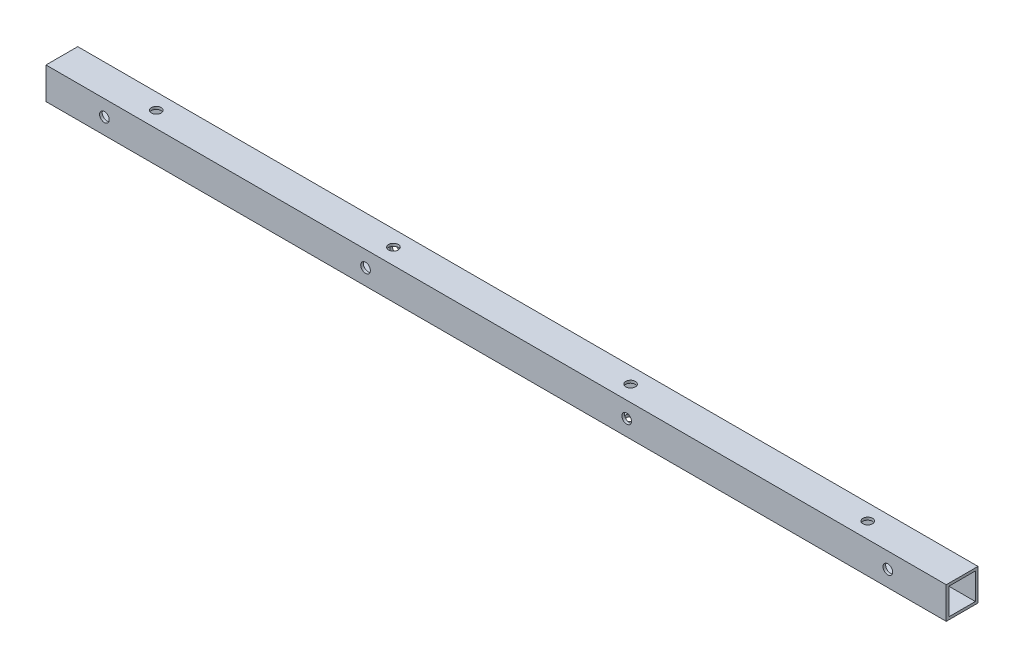
ISO-10303-21;
HEADER;
FILE_DESCRIPTION(('STEP AP214'),'2;1');
FILE_NAME('part.step','',(''),(''),'','','');
FILE_SCHEMA(('AUTOMOTIVE_DESIGN { 1 0 10303 214 1 1 1 1 }'));
ENDSEC;
DATA;
#1=APPLICATION_CONTEXT('core data for automotive mechanical design processes');
#2=APPLICATION_PROTOCOL_DEFINITION('international standard','automotive_design',2000,#1);
#3=PRODUCT_CONTEXT('',#1,'mechanical');
#4=PRODUCT('Part','Part','',(#3));
#5=PRODUCT_RELATED_PRODUCT_CATEGORY('part','',(#4));
#6=PRODUCT_DEFINITION_FORMATION('','',#4);
#7=PRODUCT_DEFINITION_CONTEXT('part definition',#1,'design');
#8=PRODUCT_DEFINITION('design','',#6,#7);
#9=PRODUCT_DEFINITION_SHAPE('','',#8);
#10=(LENGTH_UNIT() NAMED_UNIT(*) SI_UNIT(.MILLI.,.METRE.));
#11=(NAMED_UNIT(*) PLANE_ANGLE_UNIT() SI_UNIT($,.RADIAN.));
#12=(NAMED_UNIT(*) SI_UNIT($,.STERADIAN.) SOLID_ANGLE_UNIT());
#13=UNCERTAINTY_MEASURE_WITH_UNIT(LENGTH_MEASURE(1.E-05),#10,'distance_accuracy_value','');
#14=(GEOMETRIC_REPRESENTATION_CONTEXT(3) GLOBAL_UNCERTAINTY_ASSIGNED_CONTEXT((#13)) GLOBAL_UNIT_ASSIGNED_CONTEXT((#10,
#11,#12)) REPRESENTATION_CONTEXT('',''));
#15=CARTESIAN_POINT('',(0.,0.,0.));
#16=DIRECTION('',(0.,0.,1.));
#17=DIRECTION('',(1.,0.,0.));
#18=AXIS2_PLACEMENT_3D('',#15,#16,#17);
#19=CARTESIAN_POINT('',(483.3366,-9.52500000000001,0.));
#20=DIRECTION('',(0.,1.,0.));
#21=DIRECTION('',(0.,0.,1.));
#22=AXIS2_PLACEMENT_3D('',#19,#20,#21);
#23=CYLINDRICAL_SURFACE('',#22,2.8956);
#24=CARTESIAN_POINT('',(483.3366,7.9375,0.));
#25=DIRECTION('',(0.,-1.,0.));
#26=DIRECTION('',(0.,0.,-1.));
#27=AXIS2_PLACEMENT_3D('',#24,#25,#26);
#28=CIRCLE('',#27,2.8956);
#29=CARTESIAN_POINT('',(483.3366,7.9375,-2.8956));
#30=VERTEX_POINT('',#29);
#31=EDGE_CURVE('E40',#30,#30,#28,.T.);
#32=ORIENTED_EDGE('',*,*,#31,.T.);
#33=EDGE_LOOP('',(#32));
#34=FACE_BOUND('',#33,.T.);
#35=CARTESIAN_POINT('',(483.3366,9.525,0.));
#36=DIRECTION('',(0.,1.,0.));
#37=DIRECTION('',(0.,0.,1.));
#38=AXIS2_PLACEMENT_3D('',#35,#36,#37);
#39=CIRCLE('',#38,2.8956);
#40=CARTESIAN_POINT('',(483.3366,9.525,2.8956));
#41=VERTEX_POINT('',#40);
#42=EDGE_CURVE('E11',#41,#41,#39,.T.);
#43=ORIENTED_EDGE('',*,*,#42,.T.);
#44=EDGE_LOOP('',(#43));
#45=FACE_BOUND('',#44,.T.);
#46=ADVANCED_FACE('F33',(#34,#45),#23,.F.);
#47=CARTESIAN_POINT('',(341.0966,-9.52500000000001,0.));
#48=DIRECTION('',(0.,1.,0.));
#49=DIRECTION('',(0.,0.,1.));
#50=AXIS2_PLACEMENT_3D('',#47,#48,#49);
#51=CYLINDRICAL_SURFACE('',#50,2.8956);
#52=CARTESIAN_POINT('',(341.0966,7.9375,0.));
#53=DIRECTION('',(0.,-1.,0.));
#54=DIRECTION('',(0.,0.,-1.));
#55=AXIS2_PLACEMENT_3D('',#52,#53,#54);
#56=CIRCLE('',#55,2.8956);
#57=CARTESIAN_POINT('',(341.0966,7.9375,-2.8956));
#58=VERTEX_POINT('',#57);
#59=EDGE_CURVE('E212',#58,#58,#56,.T.);
#60=ORIENTED_EDGE('',*,*,#59,.T.);
#61=EDGE_LOOP('',(#60));
#62=FACE_BOUND('',#61,.T.);
#63=CARTESIAN_POINT('',(341.0966,9.525,0.));
#64=DIRECTION('',(0.,1.,0.));
#65=DIRECTION('',(0.,0.,1.));
#66=AXIS2_PLACEMENT_3D('',#63,#64,#65);
#67=CIRCLE('',#66,2.8956);
#68=CARTESIAN_POINT('',(341.0966,9.525,2.8956));
#69=VERTEX_POINT('',#68);
#70=EDGE_CURVE('E215',#69,#69,#67,.T.);
#71=ORIENTED_EDGE('',*,*,#70,.T.);
#72=EDGE_LOOP('',(#71));
#73=FACE_BOUND('',#72,.T.);
#74=ADVANCED_FACE('F239',(#62,#73),#51,.F.);
#75=CARTESIAN_POINT('',(483.3366,-9.52500000000001,0.));
#76=DIRECTION('',(0.,1.,0.));
#77=DIRECTION('',(0.,0.,1.));
#78=AXIS2_PLACEMENT_3D('',#75,#76,#77);
#79=CYLINDRICAL_SURFACE('',#78,2.8956);
#80=CARTESIAN_POINT('',(483.3366,-7.9375,0.));
#81=DIRECTION('',(0.,1.,0.));
#82=DIRECTION('',(0.,0.,1.));
#83=AXIS2_PLACEMENT_3D('',#80,#81,#82);
#84=CIRCLE('',#83,2.8956);
#85=CARTESIAN_POINT('',(483.3366,-7.9375,2.8956));
#86=VERTEX_POINT('',#85);
#87=EDGE_CURVE('E206',#86,#86,#84,.T.);
#88=ORIENTED_EDGE('',*,*,#87,.T.);
#89=EDGE_LOOP('',(#88));
#90=FACE_BOUND('',#89,.T.);
#91=CARTESIAN_POINT('',(483.3366,-9.52500000000001,0.));
#92=DIRECTION('',(0.,1.,0.));
#93=DIRECTION('',(0.,0.,1.));
#94=AXIS2_PLACEMENT_3D('',#91,#92,#93);
#95=CIRCLE('',#94,2.8956);
#96=CARTESIAN_POINT('',(483.3366,-9.52500000000001,2.8956));
#97=VERTEX_POINT('',#96);
#98=EDGE_CURVE('E209',#97,#97,#95,.T.);
#99=ORIENTED_EDGE('',*,*,#98,.F.);
#100=EDGE_LOOP('',(#99));
#101=FACE_BOUND('',#100,.T.);
#102=ADVANCED_FACE('F243',(#90,#101),#79,.F.);
#103=CARTESIAN_POINT('',(341.0966,-9.52500000000001,0.));
#104=DIRECTION('',(0.,1.,0.));
#105=DIRECTION('',(0.,0.,1.));
#106=AXIS2_PLACEMENT_3D('',#103,#104,#105);
#107=CYLINDRICAL_SURFACE('',#106,2.8956);
#108=CARTESIAN_POINT('',(341.0966,-7.9375,0.));
#109=DIRECTION('',(0.,1.,0.));
#110=DIRECTION('',(0.,0.,1.));
#111=AXIS2_PLACEMENT_3D('',#108,#109,#110);
#112=CIRCLE('',#111,2.8956);
#113=CARTESIAN_POINT('',(341.0966,-7.9375,2.8956));
#114=VERTEX_POINT('',#113);
#115=EDGE_CURVE('E195',#114,#114,#112,.T.);
#116=ORIENTED_EDGE('',*,*,#115,.T.);
#117=EDGE_LOOP('',(#116));
#118=FACE_BOUND('',#117,.T.);
#119=CARTESIAN_POINT('',(341.0966,-9.52500000000001,0.));
#120=DIRECTION('',(0.,1.,0.));
#121=DIRECTION('',(0.,0.,1.));
#122=AXIS2_PLACEMENT_3D('',#119,#120,#121);
#123=CIRCLE('',#122,2.8956);
#124=CARTESIAN_POINT('',(341.0966,-9.52500000000001,2.8956));
#125=VERTEX_POINT('',#124);
#126=EDGE_CURVE('E203',#125,#125,#123,.T.);
#127=ORIENTED_EDGE('',*,*,#126,.F.);
#128=EDGE_LOOP('',(#127));
#129=FACE_BOUND('',#128,.T.);
#130=ADVANCED_FACE('F248',(#118,#129),#107,.F.);
#131=CARTESIAN_POINT('',(35.0265999999999,0.,-9.525));
#132=DIRECTION('',(0.,0.,1.));
#133=DIRECTION('',(1.,0.,0.));
#134=AXIS2_PLACEMENT_3D('',#131,#132,#133);
#135=CYLINDRICAL_SURFACE('',#134,2.89559999999999);
#136=CARTESIAN_POINT('',(35.0265999999999,0.,7.9375));
#137=DIRECTION('',(0.,0.,-1.));
#138=DIRECTION('',(-1.,0.,0.));
#139=AXIS2_PLACEMENT_3D('',#136,#137,#138);
#140=CIRCLE('',#139,2.89559999999999);
#141=CARTESIAN_POINT('',(32.1309999999999,0.,7.9375));
#142=VERTEX_POINT('',#141);
#143=EDGE_CURVE('E189',#142,#142,#140,.T.);
#144=ORIENTED_EDGE('',*,*,#143,.T.);
#145=EDGE_LOOP('',(#144));
#146=FACE_BOUND('',#145,.T.);
#147=CARTESIAN_POINT('',(35.0265999999999,0.,9.525));
#148=DIRECTION('',(0.,0.,1.));
#149=DIRECTION('',(1.,0.,0.));
#150=AXIS2_PLACEMENT_3D('',#147,#148,#149);
#151=CIRCLE('',#150,2.89559999999999);
#152=CARTESIAN_POINT('',(37.9221999999998,0.,9.525));
#153=VERTEX_POINT('',#152);
#154=EDGE_CURVE('E192',#153,#153,#151,.T.);
#155=ORIENTED_EDGE('',*,*,#154,.T.);
#156=EDGE_LOOP('',(#155));
#157=FACE_BOUND('',#156,.T.);
#158=ADVANCED_FACE('F255',(#146,#157),#135,.F.);
#159=CARTESIAN_POINT('',(191.659933333333,0.,-9.525));
#160=DIRECTION('',(0.,0.,1.));
#161=DIRECTION('',(1.,0.,0.));
#162=AXIS2_PLACEMENT_3D('',#159,#160,#161);
#163=CYLINDRICAL_SURFACE('',#162,2.89559999999999);
#164=CARTESIAN_POINT('',(191.659933333333,0.,7.9375));
#165=DIRECTION('',(0.,0.,-1.));
#166=DIRECTION('',(-1.,0.,0.));
#167=AXIS2_PLACEMENT_3D('',#164,#165,#166);
#168=CIRCLE('',#167,2.89559999999999);
#169=CARTESIAN_POINT('',(188.764333333333,0.,7.9375));
#170=VERTEX_POINT('',#169);
#171=EDGE_CURVE('E183',#170,#170,#168,.T.);
#172=ORIENTED_EDGE('',*,*,#171,.T.);
#173=EDGE_LOOP('',(#172));
#174=FACE_BOUND('',#173,.T.);
#175=CARTESIAN_POINT('',(191.659933333333,0.,9.525));
#176=DIRECTION('',(0.,0.,1.));
#177=DIRECTION('',(1.,0.,0.));
#178=AXIS2_PLACEMENT_3D('',#175,#176,#177);
#179=CIRCLE('',#178,2.89559999999999);
#180=CARTESIAN_POINT('',(194.555533333333,0.,9.525));
#181=VERTEX_POINT('',#180);
#182=EDGE_CURVE('E186',#181,#181,#179,.T.);
#183=ORIENTED_EDGE('',*,*,#182,.T.);
#184=EDGE_LOOP('',(#183));
#185=FACE_BOUND('',#184,.T.);
#186=ADVANCED_FACE('F259',(#174,#185),#163,.F.);
#187=CARTESIAN_POINT('',(35.0265999999999,0.,-9.525));
#188=DIRECTION('',(0.,0.,1.));
#189=DIRECTION('',(1.,0.,0.));
#190=AXIS2_PLACEMENT_3D('',#187,#188,#189);
#191=CYLINDRICAL_SURFACE('',#190,2.89559999999999);
#192=CARTESIAN_POINT('',(35.0265999999999,0.,-7.9375));
#193=DIRECTION('',(0.,0.,1.));
#194=DIRECTION('',(1.,0.,0.));
#195=AXIS2_PLACEMENT_3D('',#192,#193,#194);
#196=CIRCLE('',#195,2.89559999999999);
#197=CARTESIAN_POINT('',(37.9221999999998,0.,-7.9375));
#198=VERTEX_POINT('',#197);
#199=EDGE_CURVE('E177',#198,#198,#196,.T.);
#200=ORIENTED_EDGE('',*,*,#199,.T.);
#201=EDGE_LOOP('',(#200));
#202=FACE_BOUND('',#201,.T.);
#203=CARTESIAN_POINT('',(35.0265999999999,0.,-9.525));
#204=DIRECTION('',(0.,0.,1.));
#205=DIRECTION('',(1.,0.,0.));
#206=AXIS2_PLACEMENT_3D('',#203,#204,#205);
#207=CIRCLE('',#206,2.89559999999999);
#208=CARTESIAN_POINT('',(37.9221999999998,0.,-9.525));
#209=VERTEX_POINT('',#208);
#210=EDGE_CURVE('E180',#209,#209,#207,.T.);
#211=ORIENTED_EDGE('',*,*,#210,.F.);
#212=EDGE_LOOP('',(#211));
#213=FACE_BOUND('',#212,.T.);
#214=ADVANCED_FACE('F263',(#202,#213),#191,.F.);
#215=CARTESIAN_POINT('',(191.659933333333,0.,-9.525));
#216=DIRECTION('',(0.,0.,1.));
#217=DIRECTION('',(1.,0.,0.));
#218=AXIS2_PLACEMENT_3D('',#215,#216,#217);
#219=CYLINDRICAL_SURFACE('',#218,2.89559999999999);
#220=CARTESIAN_POINT('',(191.659933333333,0.,-7.9375));
#221=DIRECTION('',(0.,0.,1.));
#222=DIRECTION('',(1.,0.,0.));
#223=AXIS2_PLACEMENT_3D('',#220,#221,#222);
#224=CIRCLE('',#223,2.89559999999999);
#225=CARTESIAN_POINT('',(194.555533333333,0.,-7.9375));
#226=VERTEX_POINT('',#225);
#227=EDGE_CURVE('E167',#226,#226,#224,.T.);
#228=ORIENTED_EDGE('',*,*,#227,.T.);
#229=EDGE_LOOP('',(#228));
#230=FACE_BOUND('',#229,.T.);
#231=CARTESIAN_POINT('',(191.659933333333,0.,-9.525));
#232=DIRECTION('',(0.,0.,1.));
#233=DIRECTION('',(1.,0.,0.));
#234=AXIS2_PLACEMENT_3D('',#231,#232,#233);
#235=CIRCLE('',#234,2.89559999999999);
#236=CARTESIAN_POINT('',(194.555533333333,0.,-9.525));
#237=VERTEX_POINT('',#236);
#238=EDGE_CURVE('E174',#237,#237,#235,.T.);
#239=ORIENTED_EDGE('',*,*,#238,.F.);
#240=EDGE_LOOP('',(#239));
#241=FACE_BOUND('',#240,.T.);
#242=ADVANCED_FACE('F267',(#230,#241),#219,.F.);
#243=CARTESIAN_POINT('',(539.9532,0.,0.));
#244=DIRECTION('',(1.,0.,0.));
#245=DIRECTION('',(0.,0.,-1.));
#246=AXIS2_PLACEMENT_3D('',#243,#244,#245);
#247=PLANE('',#246);
#248=DIRECTION('',(0.,0.,-1.));
#249=VECTOR('',#248,1.);
#250=CARTESIAN_POINT('',(539.9532,-9.525,-9.525));
#251=LINE('',#250,#249);
#252=CARTESIAN_POINT('',(539.9532,-9.525,9.525));
#253=VERTEX_POINT('',#252);
#254=CARTESIAN_POINT('',(539.9532,-9.525,-9.525));
#255=VERTEX_POINT('',#254);
#256=EDGE_CURVE('E138',#253,#255,#251,.T.);
#257=ORIENTED_EDGE('',*,*,#256,.T.);
#258=DIRECTION('',(0.,1.,0.));
#259=VECTOR('',#258,1.);
#260=CARTESIAN_POINT('',(539.9532,9.525,-9.525));
#261=LINE('',#260,#259);
#262=CARTESIAN_POINT('',(539.9532,9.525,-9.525));
#263=VERTEX_POINT('',#262);
#264=EDGE_CURVE('E141',#255,#263,#261,.T.);
#265=ORIENTED_EDGE('',*,*,#264,.T.);
#266=DIRECTION('',(0.,0.,1.));
#267=VECTOR('',#266,1.);
#268=CARTESIAN_POINT('',(539.9532,9.525,-9.525));
#269=LINE('',#268,#267);
#270=CARTESIAN_POINT('',(539.9532,9.525,9.525));
#271=VERTEX_POINT('',#270);
#272=EDGE_CURVE('E144',#263,#271,#269,.T.);
#273=ORIENTED_EDGE('',*,*,#272,.T.);
#274=DIRECTION('',(0.,-1.,0.));
#275=VECTOR('',#274,1.);
#276=CARTESIAN_POINT('',(539.9532,9.525,9.525));
#277=LINE('',#276,#275);
#278=EDGE_CURVE('E146',#271,#253,#277,.T.);
#279=ORIENTED_EDGE('',*,*,#278,.T.);
#280=EDGE_LOOP('',(#257,#265,#273,#279));
#281=FACE_BOUND('',#280,.T.);
#282=DIRECTION('',(0.,1.,0.));
#283=VECTOR('',#282,1.);
#284=CARTESIAN_POINT('',(539.9532,7.9375,-7.9375));
#285=LINE('',#284,#283);
#286=CARTESIAN_POINT('',(539.9532,-7.9375,-7.9375));
#287=VERTEX_POINT('',#286);
#288=CARTESIAN_POINT('',(539.9532,7.9375,-7.9375));
#289=VERTEX_POINT('',#288);
#290=EDGE_CURVE('E106',#287,#289,#285,.T.);
#291=ORIENTED_EDGE('',*,*,#290,.F.);
#292=DIRECTION('',(0.,0.,-1.));
#293=VECTOR('',#292,1.);
#294=CARTESIAN_POINT('',(539.9532,-7.9375,-7.9375));
#295=LINE('',#294,#293);
#296=CARTESIAN_POINT('',(539.9532,-7.9375,7.9375));
#297=VERTEX_POINT('',#296);
#298=EDGE_CURVE('E97',#297,#287,#295,.T.);
#299=ORIENTED_EDGE('',*,*,#298,.F.);
#300=DIRECTION('',(0.,-1.,0.));
#301=VECTOR('',#300,1.);
#302=CARTESIAN_POINT('',(539.9532,7.9375,7.9375));
#303=LINE('',#302,#301);
#304=CARTESIAN_POINT('',(539.9532,7.9375,7.9375));
#305=VERTEX_POINT('',#304);
#306=EDGE_CURVE('E122',#305,#297,#303,.T.);
#307=ORIENTED_EDGE('',*,*,#306,.F.);
#308=DIRECTION('',(0.,0.,1.));
#309=VECTOR('',#308,1.);
#310=CARTESIAN_POINT('',(539.9532,7.9375,-7.9375));
#311=LINE('',#310,#309);
#312=EDGE_CURVE('E120',#289,#305,#311,.T.);
#313=ORIENTED_EDGE('',*,*,#312,.F.);
#314=EDGE_LOOP('',(#291,#299,#307,#313));
#315=FACE_BOUND('',#314,.T.);
#316=ADVANCED_FACE('F119',(#281,#315),#247,.T.);
#317=CARTESIAN_POINT('',(0.,0.,0.));
#318=DIRECTION('',(1.,0.,0.));
#319=DIRECTION('',(0.,0.,-1.));
#320=AXIS2_PLACEMENT_3D('',#317,#318,#319);
#321=PLANE('',#320);
#322=DIRECTION('',(0.,0.,-1.));
#323=VECTOR('',#322,1.);
#324=CARTESIAN_POINT('',(0.,-9.525,-9.525));
#325=LINE('',#324,#323);
#326=CARTESIAN_POINT('',(0.,-9.525,9.525));
#327=VERTEX_POINT('',#326);
#328=CARTESIAN_POINT('',(0.,-9.525,-9.525));
#329=VERTEX_POINT('',#328);
#330=EDGE_CURVE('E115',#327,#329,#325,.T.);
#331=ORIENTED_EDGE('',*,*,#330,.F.);
#332=DIRECTION('',(0.,-1.,0.));
#333=VECTOR('',#332,1.);
#334=CARTESIAN_POINT('',(0.,9.525,9.525));
#335=LINE('',#334,#333);
#336=CARTESIAN_POINT('',(0.,9.525,9.525));
#337=VERTEX_POINT('',#336);
#338=EDGE_CURVE('E142',#337,#327,#335,.T.);
#339=ORIENTED_EDGE('',*,*,#338,.F.);
#340=DIRECTION('',(0.,0.,1.));
#341=VECTOR('',#340,1.);
#342=CARTESIAN_POINT('',(0.,9.525,-9.525));
#343=LINE('',#342,#341);
#344=CARTESIAN_POINT('',(0.,9.525,-9.525));
#345=VERTEX_POINT('',#344);
#346=EDGE_CURVE('E153',#345,#337,#343,.T.);
#347=ORIENTED_EDGE('',*,*,#346,.F.);
#348=DIRECTION('',(0.,1.,0.));
#349=VECTOR('',#348,1.);
#350=CARTESIAN_POINT('',(0.,9.525,-9.525));
#351=LINE('',#350,#349);
#352=EDGE_CURVE('E151',#329,#345,#351,.T.);
#353=ORIENTED_EDGE('',*,*,#352,.F.);
#354=EDGE_LOOP('',(#331,#339,#347,#353));
#355=FACE_BOUND('',#354,.T.);
#356=DIRECTION('',(0.,0.,-1.));
#357=VECTOR('',#356,1.);
#358=CARTESIAN_POINT('',(0.,-7.9375,-7.9375));
#359=LINE('',#358,#357);
#360=CARTESIAN_POINT('',(0.,-7.9375,7.9375));
#361=VERTEX_POINT('',#360);
#362=CARTESIAN_POINT('',(0.,-7.9375,-7.9375));
#363=VERTEX_POINT('',#362);
#364=EDGE_CURVE('E55',#361,#363,#359,.T.);
#365=ORIENTED_EDGE('',*,*,#364,.T.);
#366=DIRECTION('',(0.,1.,0.));
#367=VECTOR('',#366,1.);
#368=CARTESIAN_POINT('',(0.,7.9375,-7.9375));
#369=LINE('',#368,#367);
#370=CARTESIAN_POINT('',(0.,7.9375,-7.9375));
#371=VERTEX_POINT('',#370);
#372=EDGE_CURVE('E114',#363,#371,#369,.T.);
#373=ORIENTED_EDGE('',*,*,#372,.T.);
#374=DIRECTION('',(0.,0.,1.));
#375=VECTOR('',#374,1.);
#376=CARTESIAN_POINT('',(0.,7.9375,-7.9375));
#377=LINE('',#376,#375);
#378=CARTESIAN_POINT('',(0.,7.9375,7.9375));
#379=VERTEX_POINT('',#378);
#380=EDGE_CURVE('E130',#371,#379,#377,.T.);
#381=ORIENTED_EDGE('',*,*,#380,.T.);
#382=DIRECTION('',(0.,-1.,0.));
#383=VECTOR('',#382,1.);
#384=CARTESIAN_POINT('',(0.,7.9375,7.9375));
#385=LINE('',#384,#383);
#386=EDGE_CURVE('E107',#379,#361,#385,.T.);
#387=ORIENTED_EDGE('',*,*,#386,.T.);
#388=EDGE_LOOP('',(#365,#373,#381,#387));
#389=FACE_BOUND('',#388,.T.);
#390=ADVANCED_FACE('F276',(#355,#389),#321,.F.);
#391=CARTESIAN_POINT('',(539.9532,-9.525,-9.525));
#392=DIRECTION('',(0.,1.,0.));
#393=DIRECTION('',(0.,0.,1.));
#394=AXIS2_PLACEMENT_3D('',#391,#392,#393);
#395=PLANE('',#394);
#396=CARTESIAN_POINT('',(198.8566,-9.52500000000001,0.));
#397=DIRECTION('',(0.,1.,0.));
#398=DIRECTION('',(0.,0.,1.));
#399=AXIS2_PLACEMENT_3D('',#396,#397,#398);
#400=CIRCLE('',#399,2.8956);
#401=CARTESIAN_POINT('',(198.8566,-9.52500000000001,2.8956));
#402=VERTEX_POINT('',#401);
#403=EDGE_CURVE('E416',#402,#402,#400,.T.);
#404=ORIENTED_EDGE('',*,*,#403,.T.);
#405=EDGE_LOOP('',(#404));
#406=FACE_BOUND('',#405,.T.);
#407=CARTESIAN_POINT('',(56.6166,-9.52500000000001,0.));
#408=DIRECTION('',(0.,1.,0.));
#409=DIRECTION('',(0.,0.,1.));
#410=AXIS2_PLACEMENT_3D('',#407,#408,#409);
#411=CIRCLE('',#410,2.8956);
#412=CARTESIAN_POINT('',(56.6166,-9.52500000000001,2.8956));
#413=VERTEX_POINT('',#412);
#414=EDGE_CURVE('E200',#413,#413,#411,.T.);
#415=ORIENTED_EDGE('',*,*,#414,.T.);
#416=EDGE_LOOP('',(#415));
#417=FACE_BOUND('',#416,.T.);
#418=ORIENTED_EDGE('',*,*,#330,.T.);
#419=DIRECTION('',(-1.,0.,0.));
#420=VECTOR('',#419,1.);
#421=CARTESIAN_POINT('',(539.9532,-9.525,-9.525));
#422=LINE('',#421,#420);
#423=EDGE_CURVE('E164',#255,#329,#422,.T.);
#424=ORIENTED_EDGE('',*,*,#423,.F.);
#425=ORIENTED_EDGE('',*,*,#256,.F.);
#426=DIRECTION('',(-1.,0.,0.));
#427=VECTOR('',#426,1.);
#428=CARTESIAN_POINT('',(539.9532,-9.525,9.525));
#429=LINE('',#428,#427);
#430=EDGE_CURVE('E148',#253,#327,#429,.T.);
#431=ORIENTED_EDGE('',*,*,#430,.T.);
#432=EDGE_LOOP('',(#418,#424,#425,#431));
#433=FACE_BOUND('',#432,.T.);
#434=ORIENTED_EDGE('',*,*,#126,.T.);
#435=EDGE_LOOP('',(#434));
#436=FACE_BOUND('',#435,.T.);
#437=ORIENTED_EDGE('',*,*,#98,.T.);
#438=EDGE_LOOP('',(#437));
#439=FACE_BOUND('',#438,.T.);
#440=ADVANCED_FACE('F272',(#406,#417,#433,#436,#439),#395,.F.);
#441=CARTESIAN_POINT('',(539.9532,9.525,-9.525));
#442=DIRECTION('',(0.,0.,1.));
#443=DIRECTION('',(1.,0.,0.));
#444=AXIS2_PLACEMENT_3D('',#441,#442,#443);
#445=PLANE('',#444);
#446=CARTESIAN_POINT('',(348.293266666667,0.,-9.525));
#447=DIRECTION('',(0.,0.,1.));
#448=DIRECTION('',(1.,0.,0.));
#449=AXIS2_PLACEMENT_3D('',#446,#447,#448);
#450=CIRCLE('',#449,2.89559999999999);
#451=CARTESIAN_POINT('',(351.188866666667,0.,-9.525));
#452=VERTEX_POINT('',#451);
#453=EDGE_CURVE('E320',#452,#452,#450,.T.);
#454=ORIENTED_EDGE('',*,*,#453,.T.);
#455=EDGE_LOOP('',(#454));
#456=FACE_BOUND('',#455,.T.);
#457=CARTESIAN_POINT('',(504.9266,0.,-9.525));
#458=DIRECTION('',(0.,0.,1.));
#459=DIRECTION('',(1.,0.,0.));
#460=AXIS2_PLACEMENT_3D('',#457,#458,#459);
#461=CIRCLE('',#460,2.89559999999999);
#462=CARTESIAN_POINT('',(507.8222,0.,-9.525));
#463=VERTEX_POINT('',#462);
#464=EDGE_CURVE('E171',#463,#463,#461,.T.);
#465=ORIENTED_EDGE('',*,*,#464,.T.);
#466=EDGE_LOOP('',(#465));
#467=FACE_BOUND('',#466,.T.);
#468=ORIENTED_EDGE('',*,*,#352,.T.);
#469=DIRECTION('',(-1.,0.,0.));
#470=VECTOR('',#469,1.);
#471=CARTESIAN_POINT('',(539.9532,9.525,-9.525));
#472=LINE('',#471,#470);
#473=EDGE_CURVE('E161',#263,#345,#472,.T.);
#474=ORIENTED_EDGE('',*,*,#473,.F.);
#475=ORIENTED_EDGE('',*,*,#264,.F.);
#476=ORIENTED_EDGE('',*,*,#423,.T.);
#477=EDGE_LOOP('',(#468,#474,#475,#476));
#478=FACE_BOUND('',#477,.T.);
#479=ORIENTED_EDGE('',*,*,#238,.T.);
#480=EDGE_LOOP('',(#479));
#481=FACE_BOUND('',#480,.T.);
#482=ORIENTED_EDGE('',*,*,#210,.T.);
#483=EDGE_LOOP('',(#482));
#484=FACE_BOUND('',#483,.T.);
#485=ADVANCED_FACE('F275',(#456,#467,#478,#481,#484),#445,.F.);
#486=CARTESIAN_POINT('',(539.9532,9.525,-9.525));
#487=DIRECTION('',(0.,-1.,0.));
#488=DIRECTION('',(0.,0.,-1.));
#489=AXIS2_PLACEMENT_3D('',#486,#487,#488);
#490=PLANE('',#489);
#491=CARTESIAN_POINT('',(198.8566,9.525,0.));
#492=DIRECTION('',(0.,1.,0.));
#493=DIRECTION('',(0.,0.,1.));
#494=AXIS2_PLACEMENT_3D('',#491,#492,#493);
#495=CIRCLE('',#494,2.8956);
#496=CARTESIAN_POINT('',(198.8566,9.525,2.8956));
#497=VERTEX_POINT('',#496);
#498=EDGE_CURVE('E414',#497,#497,#495,.T.);
#499=ORIENTED_EDGE('',*,*,#498,.F.);
#500=EDGE_LOOP('',(#499));
#501=FACE_BOUND('',#500,.T.);
#502=CARTESIAN_POINT('',(56.6166,9.525,0.));
#503=DIRECTION('',(0.,1.,0.));
#504=DIRECTION('',(0.,0.,1.));
#505=AXIS2_PLACEMENT_3D('',#502,#503,#504);
#506=CIRCLE('',#505,2.8956);
#507=CARTESIAN_POINT('',(56.6166,9.525,2.8956));
#508=VERTEX_POINT('',#507);
#509=EDGE_CURVE('E312',#508,#508,#506,.T.);
#510=ORIENTED_EDGE('',*,*,#509,.F.);
#511=EDGE_LOOP('',(#510));
#512=FACE_BOUND('',#511,.T.);
#513=ORIENTED_EDGE('',*,*,#346,.T.);
#514=DIRECTION('',(-1.,0.,0.));
#515=VECTOR('',#514,1.);
#516=CARTESIAN_POINT('',(539.9532,9.525,9.525));
#517=LINE('',#516,#515);
#518=EDGE_CURVE('E158',#271,#337,#517,.T.);
#519=ORIENTED_EDGE('',*,*,#518,.F.);
#520=ORIENTED_EDGE('',*,*,#272,.F.);
#521=ORIENTED_EDGE('',*,*,#473,.T.);
#522=EDGE_LOOP('',(#513,#519,#520,#521));
#523=FACE_BOUND('',#522,.T.);
#524=ORIENTED_EDGE('',*,*,#70,.F.);
#525=EDGE_LOOP('',(#524));
#526=FACE_BOUND('',#525,.T.);
#527=ORIENTED_EDGE('',*,*,#42,.F.);
#528=EDGE_LOOP('',(#527));
#529=FACE_BOUND('',#528,.T.);
#530=ADVANCED_FACE('F280',(#501,#512,#523,#526,#529),#490,.F.);
#531=CARTESIAN_POINT('',(539.9532,9.525,9.525));
#532=DIRECTION('',(0.,0.,-1.));
#533=DIRECTION('',(-1.,0.,0.));
#534=AXIS2_PLACEMENT_3D('',#531,#532,#533);
#535=PLANE('',#534);
#536=CARTESIAN_POINT('',(348.293266666667,0.,9.525));
#537=DIRECTION('',(0.,0.,1.));
#538=DIRECTION('',(1.,0.,0.));
#539=AXIS2_PLACEMENT_3D('',#536,#537,#538);
#540=CIRCLE('',#539,2.89559999999999);
#541=CARTESIAN_POINT('',(351.188866666667,0.,9.525));
#542=VERTEX_POINT('',#541);
#543=EDGE_CURVE('E309',#542,#542,#540,.T.);
#544=ORIENTED_EDGE('',*,*,#543,.F.);
#545=EDGE_LOOP('',(#544));
#546=FACE_BOUND('',#545,.T.);
#547=CARTESIAN_POINT('',(504.9266,0.,9.525));
#548=DIRECTION('',(0.,0.,1.));
#549=DIRECTION('',(1.,0.,0.));
#550=AXIS2_PLACEMENT_3D('',#547,#548,#549);
#551=CIRCLE('',#550,2.89559999999999);
#552=CARTESIAN_POINT('',(507.8222,0.,9.525));
#553=VERTEX_POINT('',#552);
#554=EDGE_CURVE('E323',#553,#553,#551,.T.);
#555=ORIENTED_EDGE('',*,*,#554,.F.);
#556=EDGE_LOOP('',(#555));
#557=FACE_BOUND('',#556,.T.);
#558=ORIENTED_EDGE('',*,*,#338,.T.);
#559=ORIENTED_EDGE('',*,*,#430,.F.);
#560=ORIENTED_EDGE('',*,*,#278,.F.);
#561=ORIENTED_EDGE('',*,*,#518,.T.);
#562=EDGE_LOOP('',(#558,#559,#560,#561));
#563=FACE_BOUND('',#562,.T.);
#564=ORIENTED_EDGE('',*,*,#182,.F.);
#565=EDGE_LOOP('',(#564));
#566=FACE_BOUND('',#565,.T.);
#567=ORIENTED_EDGE('',*,*,#154,.F.);
#568=EDGE_LOOP('',(#567));
#569=FACE_BOUND('',#568,.T.);
#570=ADVANCED_FACE('F284',(#546,#557,#563,#566,#569),#535,.F.);
#571=CARTESIAN_POINT('',(539.9532,-7.9375,-7.9375));
#572=DIRECTION('',(0.,1.,0.));
#573=DIRECTION('',(0.,0.,1.));
#574=AXIS2_PLACEMENT_3D('',#571,#572,#573);
#575=PLANE('',#574);
#576=CARTESIAN_POINT('',(198.8566,-7.9375,0.));
#577=DIRECTION('',(0.,1.,0.));
#578=DIRECTION('',(0.,0.,1.));
#579=AXIS2_PLACEMENT_3D('',#576,#577,#578);
#580=CIRCLE('',#579,2.8956);
#581=CARTESIAN_POINT('',(198.8566,-7.9375,2.8956));
#582=VERTEX_POINT('',#581);
#583=EDGE_CURVE('E302',#582,#582,#580,.T.);
#584=ORIENTED_EDGE('',*,*,#583,.F.);
#585=EDGE_LOOP('',(#584));
#586=FACE_BOUND('',#585,.T.);
#587=CARTESIAN_POINT('',(56.6166,-7.9375,0.));
#588=DIRECTION('',(0.,1.,0.));
#589=DIRECTION('',(0.,0.,1.));
#590=AXIS2_PLACEMENT_3D('',#587,#588,#589);
#591=CIRCLE('',#590,2.8956);
#592=CARTESIAN_POINT('',(56.6166,-7.9375,2.8956));
#593=VERTEX_POINT('',#592);
#594=EDGE_CURVE('E199',#593,#593,#591,.T.);
#595=ORIENTED_EDGE('',*,*,#594,.F.);
#596=EDGE_LOOP('',(#595));
#597=FACE_BOUND('',#596,.T.);
#598=ORIENTED_EDGE('',*,*,#364,.F.);
#599=DIRECTION('',(-1.,0.,0.));
#600=VECTOR('',#599,1.);
#601=CARTESIAN_POINT('',(539.9532,-7.9375,7.9375));
#602=LINE('',#601,#600);
#603=EDGE_CURVE('E102',#297,#361,#602,.T.);
#604=ORIENTED_EDGE('',*,*,#603,.F.);
#605=ORIENTED_EDGE('',*,*,#298,.T.);
#606=DIRECTION('',(-1.,0.,0.));
#607=VECTOR('',#606,1.);
#608=CARTESIAN_POINT('',(539.9532,-7.9375,-7.9375));
#609=LINE('',#608,#607);
#610=EDGE_CURVE('E101',#287,#363,#609,.T.);
#611=ORIENTED_EDGE('',*,*,#610,.T.);
#612=EDGE_LOOP('',(#598,#604,#605,#611));
#613=FACE_BOUND('',#612,.T.);
#614=ORIENTED_EDGE('',*,*,#115,.F.);
#615=EDGE_LOOP('',(#614));
#616=FACE_BOUND('',#615,.T.);
#617=ORIENTED_EDGE('',*,*,#87,.F.);
#618=EDGE_LOOP('',(#617));
#619=FACE_BOUND('',#618,.T.);
#620=ADVANCED_FACE('F99',(#586,#597,#613,#616,#619),#575,.T.);
#621=CARTESIAN_POINT('',(539.9532,7.9375,-7.9375));
#622=DIRECTION('',(0.,0.,1.));
#623=DIRECTION('',(1.,0.,0.));
#624=AXIS2_PLACEMENT_3D('',#621,#622,#623);
#625=PLANE('',#624);
#626=CARTESIAN_POINT('',(348.293266666667,0.,-7.9375));
#627=DIRECTION('',(0.,0.,1.));
#628=DIRECTION('',(1.,0.,0.));
#629=AXIS2_PLACEMENT_3D('',#626,#627,#628);
#630=CIRCLE('',#629,2.89559999999999);
#631=CARTESIAN_POINT('',(351.188866666667,0.,-7.9375));
#632=VERTEX_POINT('',#631);
#633=EDGE_CURVE('E317',#632,#632,#630,.T.);
#634=ORIENTED_EDGE('',*,*,#633,.F.);
#635=EDGE_LOOP('',(#634));
#636=FACE_BOUND('',#635,.T.);
#637=CARTESIAN_POINT('',(504.9266,0.,-7.9375));
#638=DIRECTION('',(0.,0.,1.));
#639=DIRECTION('',(1.,0.,0.));
#640=AXIS2_PLACEMENT_3D('',#637,#638,#639);
#641=CIRCLE('',#640,2.89559999999999);
#642=CARTESIAN_POINT('',(507.8222,0.,-7.9375));
#643=VERTEX_POINT('',#642);
#644=EDGE_CURVE('E128',#643,#643,#641,.T.);
#645=ORIENTED_EDGE('',*,*,#644,.F.);
#646=EDGE_LOOP('',(#645));
#647=FACE_BOUND('',#646,.T.);
#648=ORIENTED_EDGE('',*,*,#372,.F.);
#649=ORIENTED_EDGE('',*,*,#610,.F.);
#650=ORIENTED_EDGE('',*,*,#290,.T.);
#651=DIRECTION('',(-1.,0.,0.));
#652=VECTOR('',#651,1.);
#653=CARTESIAN_POINT('',(539.9532,7.9375,-7.9375));
#654=LINE('',#653,#652);
#655=EDGE_CURVE('E116',#289,#371,#654,.T.);
#656=ORIENTED_EDGE('',*,*,#655,.T.);
#657=EDGE_LOOP('',(#648,#649,#650,#656));
#658=FACE_BOUND('',#657,.T.);
#659=ORIENTED_EDGE('',*,*,#227,.F.);
#660=EDGE_LOOP('',(#659));
#661=FACE_BOUND('',#660,.T.);
#662=ORIENTED_EDGE('',*,*,#199,.F.);
#663=EDGE_LOOP('',(#662));
#664=FACE_BOUND('',#663,.T.);
#665=ADVANCED_FACE('F110',(#636,#647,#658,#661,#664),#625,.T.);
#666=CARTESIAN_POINT('',(539.9532,7.9375,-7.9375));
#667=DIRECTION('',(0.,-1.,0.));
#668=DIRECTION('',(0.,0.,-1.));
#669=AXIS2_PLACEMENT_3D('',#666,#667,#668);
#670=PLANE('',#669);
#671=CARTESIAN_POINT('',(198.8566,7.9375,0.));
#672=DIRECTION('',(0.,-1.,0.));
#673=DIRECTION('',(0.,0.,-1.));
#674=AXIS2_PLACEMENT_3D('',#671,#672,#673);
#675=CIRCLE('',#674,2.8956);
#676=CARTESIAN_POINT('',(198.8566,7.9375,-2.8956));
#677=VERTEX_POINT('',#676);
#678=EDGE_CURVE('E411',#677,#677,#675,.T.);
#679=ORIENTED_EDGE('',*,*,#678,.F.);
#680=EDGE_LOOP('',(#679));
#681=FACE_BOUND('',#680,.T.);
#682=CARTESIAN_POINT('',(56.6166,7.9375,0.));
#683=DIRECTION('',(0.,-1.,0.));
#684=DIRECTION('',(0.,0.,-1.));
#685=AXIS2_PLACEMENT_3D('',#682,#683,#684);
#686=CIRCLE('',#685,2.8956);
#687=CARTESIAN_POINT('',(56.6166,7.9375,-2.8956));
#688=VERTEX_POINT('',#687);
#689=EDGE_CURVE('E196',#688,#688,#686,.T.);
#690=ORIENTED_EDGE('',*,*,#689,.F.);
#691=EDGE_LOOP('',(#690));
#692=FACE_BOUND('',#691,.T.);
#693=ORIENTED_EDGE('',*,*,#380,.F.);
#694=ORIENTED_EDGE('',*,*,#655,.F.);
#695=ORIENTED_EDGE('',*,*,#312,.T.);
#696=DIRECTION('',(-1.,0.,0.));
#697=VECTOR('',#696,1.);
#698=CARTESIAN_POINT('',(539.9532,7.9375,7.9375));
#699=LINE('',#698,#697);
#700=EDGE_CURVE('E47',#305,#379,#699,.T.);
#701=ORIENTED_EDGE('',*,*,#700,.T.);
#702=EDGE_LOOP('',(#693,#694,#695,#701));
#703=FACE_BOUND('',#702,.T.);
#704=ORIENTED_EDGE('',*,*,#59,.F.);
#705=EDGE_LOOP('',(#704));
#706=FACE_BOUND('',#705,.T.);
#707=ORIENTED_EDGE('',*,*,#31,.F.);
#708=EDGE_LOOP('',(#707));
#709=FACE_BOUND('',#708,.T.);
#710=ADVANCED_FACE('F222',(#681,#692,#703,#706,#709),#670,.T.);
#711=CARTESIAN_POINT('',(539.9532,7.9375,7.9375));
#712=DIRECTION('',(0.,0.,-1.));
#713=DIRECTION('',(-1.,0.,0.));
#714=AXIS2_PLACEMENT_3D('',#711,#712,#713);
#715=PLANE('',#714);
#716=CARTESIAN_POINT('',(348.293266666667,0.,7.9375));
#717=DIRECTION('',(0.,0.,-1.));
#718=DIRECTION('',(-1.,0.,0.));
#719=AXIS2_PLACEMENT_3D('',#716,#717,#718);
#720=CIRCLE('',#719,2.89559999999999);
#721=CARTESIAN_POINT('',(345.397666666667,0.,7.9375));
#722=VERTEX_POINT('',#721);
#723=EDGE_CURVE('E306',#722,#722,#720,.T.);
#724=ORIENTED_EDGE('',*,*,#723,.F.);
#725=EDGE_LOOP('',(#724));
#726=FACE_BOUND('',#725,.T.);
#727=CARTESIAN_POINT('',(504.9266,0.,7.9375));
#728=DIRECTION('',(0.,0.,-1.));
#729=DIRECTION('',(-1.,0.,0.));
#730=AXIS2_PLACEMENT_3D('',#727,#728,#729);
#731=CIRCLE('',#730,2.89559999999999);
#732=CARTESIAN_POINT('',(502.031,0.,7.9375));
#733=VERTEX_POINT('',#732);
#734=EDGE_CURVE('E168',#733,#733,#731,.T.);
#735=ORIENTED_EDGE('',*,*,#734,.F.);
#736=EDGE_LOOP('',(#735));
#737=FACE_BOUND('',#736,.T.);
#738=ORIENTED_EDGE('',*,*,#386,.F.);
#739=ORIENTED_EDGE('',*,*,#700,.F.);
#740=ORIENTED_EDGE('',*,*,#306,.T.);
#741=ORIENTED_EDGE('',*,*,#603,.T.);
#742=EDGE_LOOP('',(#738,#739,#740,#741));
#743=FACE_BOUND('',#742,.T.);
#744=ORIENTED_EDGE('',*,*,#171,.F.);
#745=EDGE_LOOP('',(#744));
#746=FACE_BOUND('',#745,.T.);
#747=ORIENTED_EDGE('',*,*,#143,.F.);
#748=EDGE_LOOP('',(#747));
#749=FACE_BOUND('',#748,.T.);
#750=ADVANCED_FACE('F224',(#726,#737,#743,#746,#749),#715,.T.);
#751=CARTESIAN_POINT('',(504.9266,0.,-9.525));
#752=DIRECTION('',(0.,0.,1.));
#753=DIRECTION('',(1.,0.,0.));
#754=AXIS2_PLACEMENT_3D('',#751,#752,#753);
#755=CYLINDRICAL_SURFACE('',#754,2.89559999999999);
#756=ORIENTED_EDGE('',*,*,#734,.T.);
#757=EDGE_LOOP('',(#756));
#758=FACE_BOUND('',#757,.T.);
#759=ORIENTED_EDGE('',*,*,#554,.T.);
#760=EDGE_LOOP('',(#759));
#761=FACE_BOUND('',#760,.T.);
#762=ADVANCED_FACE('F231',(#758,#761),#755,.F.);
#763=ORIENTED_EDGE('',*,*,#644,.T.);
#764=EDGE_LOOP('',(#763));
#765=FACE_BOUND('',#764,.T.);
#766=ORIENTED_EDGE('',*,*,#464,.F.);
#767=EDGE_LOOP('',(#766));
#768=FACE_BOUND('',#767,.T.);
#769=ADVANCED_FACE('F330',(#765,#768),#755,.F.);
#770=CARTESIAN_POINT('',(348.293266666667,0.,-9.525));
#771=DIRECTION('',(0.,0.,1.));
#772=DIRECTION('',(1.,0.,0.));
#773=AXIS2_PLACEMENT_3D('',#770,#771,#772);
#774=CYLINDRICAL_SURFACE('',#773,2.89559999999999);
#775=ORIENTED_EDGE('',*,*,#633,.T.);
#776=EDGE_LOOP('',(#775));
#777=FACE_BOUND('',#776,.T.);
#778=ORIENTED_EDGE('',*,*,#453,.F.);
#779=EDGE_LOOP('',(#778));
#780=FACE_BOUND('',#779,.T.);
#781=ADVANCED_FACE('F334',(#777,#780),#774,.F.);
#782=CARTESIAN_POINT('',(348.293266666667,0.,-9.525));
#783=DIRECTION('',(0.,0.,1.));
#784=DIRECTION('',(1.,0.,0.));
#785=AXIS2_PLACEMENT_3D('',#782,#783,#784);
#786=CYLINDRICAL_SURFACE('',#785,2.89559999999999);
#787=ORIENTED_EDGE('',*,*,#723,.T.);
#788=EDGE_LOOP('',(#787));
#789=FACE_BOUND('',#788,.T.);
#790=ORIENTED_EDGE('',*,*,#543,.T.);
#791=EDGE_LOOP('',(#790));
#792=FACE_BOUND('',#791,.T.);
#793=ADVANCED_FACE('F387',(#789,#792),#786,.F.);
#794=CARTESIAN_POINT('',(56.6166,-9.52500000000001,0.));
#795=DIRECTION('',(0.,1.,0.));
#796=DIRECTION('',(0.,0.,1.));
#797=AXIS2_PLACEMENT_3D('',#794,#795,#796);
#798=CYLINDRICAL_SURFACE('',#797,2.8956);
#799=ORIENTED_EDGE('',*,*,#689,.T.);
#800=EDGE_LOOP('',(#799));
#801=FACE_BOUND('',#800,.T.);
#802=ORIENTED_EDGE('',*,*,#509,.T.);
#803=EDGE_LOOP('',(#802));
#804=FACE_BOUND('',#803,.T.);
#805=ADVANCED_FACE('F394',(#801,#804),#798,.F.);
#806=ORIENTED_EDGE('',*,*,#594,.T.);
#807=EDGE_LOOP('',(#806));
#808=FACE_BOUND('',#807,.T.);
#809=ORIENTED_EDGE('',*,*,#414,.F.);
#810=EDGE_LOOP('',(#809));
#811=FACE_BOUND('',#810,.T.);
#812=ADVANCED_FACE('F398',(#808,#811),#798,.F.);
#813=CARTESIAN_POINT('',(198.8566,-9.52500000000001,0.));
#814=DIRECTION('',(0.,1.,0.));
#815=DIRECTION('',(0.,0.,1.));
#816=AXIS2_PLACEMENT_3D('',#813,#814,#815);
#817=CYLINDRICAL_SURFACE('',#816,2.8956);
#818=ORIENTED_EDGE('',*,*,#583,.T.);
#819=EDGE_LOOP('',(#818));
#820=FACE_BOUND('',#819,.T.);
#821=ORIENTED_EDGE('',*,*,#403,.F.);
#822=EDGE_LOOP('',(#821));
#823=FACE_BOUND('',#822,.T.);
#824=ADVANCED_FACE('F400',(#820,#823),#817,.F.);
#825=CARTESIAN_POINT('',(198.8566,-9.52500000000001,0.));
#826=DIRECTION('',(0.,1.,0.));
#827=DIRECTION('',(0.,0.,1.));
#828=AXIS2_PLACEMENT_3D('',#825,#826,#827);
#829=CYLINDRICAL_SURFACE('',#828,2.8956);
#830=ORIENTED_EDGE('',*,*,#678,.T.);
#831=EDGE_LOOP('',(#830));
#832=FACE_BOUND('',#831,.T.);
#833=ORIENTED_EDGE('',*,*,#498,.T.);
#834=EDGE_LOOP('',(#833));
#835=FACE_BOUND('',#834,.T.);
#836=ADVANCED_FACE('F403',(#832,#835),#829,.F.);
#837=CLOSED_SHELL('',(#46,#74,#102,#130,#158,#186,#214,#242,#316,#390,#440,#485,#530,#570,#620,
#665,#710,#750,#762,#769,#781,#793,#805,#812,#824,#836));
#838=MANIFOLD_SOLID_BREP('B2',#837);
#839=ADVANCED_BREP_SHAPE_REPRESENTATION('',(#18,#838),#14);
#840=SHAPE_DEFINITION_REPRESENTATION(#9,#839);
ENDSEC;
END-ISO-10303-21;
